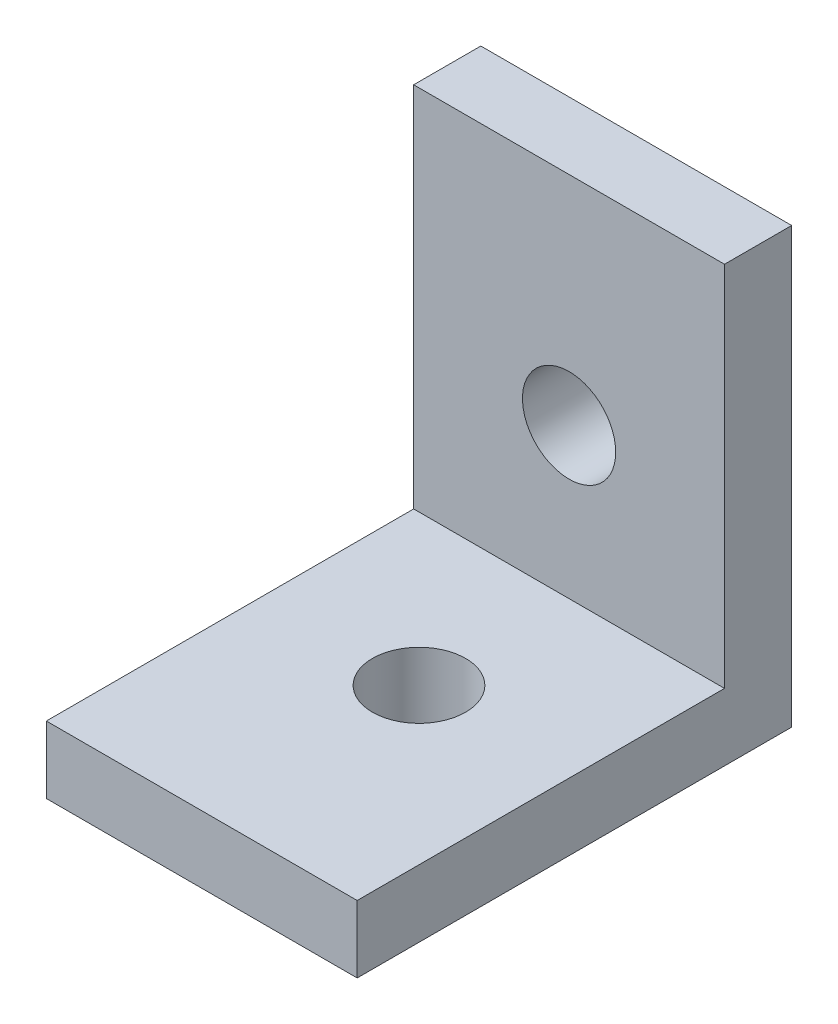
ISO-10303-21;
HEADER;
FILE_DESCRIPTION(('STEP AP214'),'2;1');
FILE_NAME('part.step','',(''),(''),'','','');
FILE_SCHEMA(('AUTOMOTIVE_DESIGN { 1 0 10303 214 1 1 1 1 }'));
ENDSEC;
DATA;
#1=APPLICATION_CONTEXT('core data for automotive mechanical design processes');
#2=APPLICATION_PROTOCOL_DEFINITION('international standard','automotive_design',2000,#1);
#3=PRODUCT_CONTEXT('',#1,'mechanical');
#4=PRODUCT('Part','Part','',(#3));
#5=PRODUCT_RELATED_PRODUCT_CATEGORY('part','',(#4));
#6=PRODUCT_DEFINITION_FORMATION('','',#4);
#7=PRODUCT_DEFINITION_CONTEXT('part definition',#1,'design');
#8=PRODUCT_DEFINITION('design','',#6,#7);
#9=PRODUCT_DEFINITION_SHAPE('','',#8);
#10=(LENGTH_UNIT() NAMED_UNIT(*) SI_UNIT(.MILLI.,.METRE.));
#11=(NAMED_UNIT(*) PLANE_ANGLE_UNIT() SI_UNIT($,.RADIAN.));
#12=(NAMED_UNIT(*) SI_UNIT($,.STERADIAN.) SOLID_ANGLE_UNIT());
#13=UNCERTAINTY_MEASURE_WITH_UNIT(LENGTH_MEASURE(1.E-05),#10,'distance_accuracy_value','');
#14=(GEOMETRIC_REPRESENTATION_CONTEXT(3) GLOBAL_UNCERTAINTY_ASSIGNED_CONTEXT((#13)) GLOBAL_UNIT_ASSIGNED_CONTEXT((#10,
#11,#12)) REPRESENTATION_CONTEXT('',''));
#15=CARTESIAN_POINT('',(0.,0.,0.));
#16=DIRECTION('',(0.,0.,1.));
#17=DIRECTION('',(1.,0.,0.));
#18=AXIS2_PLACEMENT_3D('',#15,#16,#17);
#19=CARTESIAN_POINT('',(0.,4.318,0.));
#20=DIRECTION('',(1.,0.,0.));
#21=DIRECTION('',(0.,0.,-1.));
#22=AXIS2_PLACEMENT_3D('',#19,#20,#21);
#23=PLANE('',#22);
#24=DIRECTION('',(0.,0.,1.));
#25=VECTOR('',#24,1.);
#26=CARTESIAN_POINT('',(0.,4.318,0.));
#27=LINE('',#26,#25);
#28=CARTESIAN_POINT('',(0.,4.318,-23.622));
#29=VERTEX_POINT('',#28);
#30=CARTESIAN_POINT('',(0.,4.318,0.));
#31=VERTEX_POINT('',#30);
#32=EDGE_CURVE('E100',#29,#31,#27,.T.);
#33=ORIENTED_EDGE('',*,*,#32,.F.);
#34=DIRECTION('',(0.,1.,0.));
#35=VECTOR('',#34,1.);
#36=CARTESIAN_POINT('',(0.,0.,-23.622));
#37=LINE('',#36,#35);
#38=CARTESIAN_POINT('',(0.,27.94,-23.622));
#39=VERTEX_POINT('',#38);
#40=EDGE_CURVE('E94',#29,#39,#37,.T.);
#41=ORIENTED_EDGE('',*,*,#40,.T.);
#42=DIRECTION('',(0.,0.,-1.));
#43=VECTOR('',#42,1.);
#44=CARTESIAN_POINT('',(0.,27.94,-23.622));
#45=LINE('',#44,#43);
#46=CARTESIAN_POINT('',(0.,27.94,-27.94));
#47=VERTEX_POINT('',#46);
#48=EDGE_CURVE('E97',#39,#47,#45,.T.);
#49=ORIENTED_EDGE('',*,*,#48,.T.);
#50=DIRECTION('',(0.,-1.,0.));
#51=VECTOR('',#50,1.);
#52=CARTESIAN_POINT('',(0.,4.318,-27.94));
#53=LINE('',#52,#51);
#54=CARTESIAN_POINT('',(0.,0.,-27.94));
#55=VERTEX_POINT('',#54);
#56=EDGE_CURVE('E139',#47,#55,#53,.T.);
#57=ORIENTED_EDGE('',*,*,#56,.T.);
#58=DIRECTION('',(0.,0.,1.));
#59=VECTOR('',#58,1.);
#60=CARTESIAN_POINT('',(0.,0.,0.));
#61=LINE('',#60,#59);
#62=CARTESIAN_POINT('',(0.,0.,0.));
#63=VERTEX_POINT('',#62);
#64=EDGE_CURVE('E130',#55,#63,#61,.T.);
#65=ORIENTED_EDGE('',*,*,#64,.T.);
#66=DIRECTION('',(0.,-1.,0.));
#67=VECTOR('',#66,1.);
#68=CARTESIAN_POINT('',(0.,4.318,0.));
#69=LINE('',#68,#67);
#70=EDGE_CURVE('E11',#31,#63,#69,.T.);
#71=ORIENTED_EDGE('',*,*,#70,.F.);
#72=EDGE_LOOP('',(#33,#41,#49,#57,#65,#71));
#73=FACE_BOUND('',#72,.T.);
#74=ADVANCED_FACE('F43',(#73),#23,.F.);
#75=CARTESIAN_POINT('',(0.,4.318,0.));
#76=DIRECTION('',(0.,0.,-1.));
#77=DIRECTION('',(-1.,0.,0.));
#78=AXIS2_PLACEMENT_3D('',#75,#76,#77);
#79=PLANE('',#78);
#80=DIRECTION('',(1.,0.,0.));
#81=VECTOR('',#80,1.);
#82=CARTESIAN_POINT('',(0.,0.,0.));
#83=LINE('',#82,#81);
#84=CARTESIAN_POINT('',(19.9898,0.,0.));
#85=VERTEX_POINT('',#84);
#86=EDGE_CURVE('E142',#63,#85,#83,.T.);
#87=ORIENTED_EDGE('',*,*,#86,.T.);
#88=DIRECTION('',(0.,-1.,0.));
#89=VECTOR('',#88,1.);
#90=CARTESIAN_POINT('',(19.9898,4.318,0.));
#91=LINE('',#90,#89);
#92=CARTESIAN_POINT('',(19.9898,4.318,0.));
#93=VERTEX_POINT('',#92);
#94=EDGE_CURVE('E51',#93,#85,#91,.T.);
#95=ORIENTED_EDGE('',*,*,#94,.F.);
#96=DIRECTION('',(1.,0.,0.));
#97=VECTOR('',#96,1.);
#98=CARTESIAN_POINT('',(0.,4.318,0.));
#99=LINE('',#98,#97);
#100=EDGE_CURVE('E133',#31,#93,#99,.T.);
#101=ORIENTED_EDGE('',*,*,#100,.F.);
#102=ORIENTED_EDGE('',*,*,#70,.T.);
#103=EDGE_LOOP('',(#87,#95,#101,#102));
#104=FACE_BOUND('',#103,.T.);
#105=ADVANCED_FACE('F170',(#104),#79,.F.);
#106=CARTESIAN_POINT('',(19.9898,4.318,0.));
#107=DIRECTION('',(-1.,0.,0.));
#108=DIRECTION('',(0.,0.,1.));
#109=AXIS2_PLACEMENT_3D('',#106,#107,#108);
#110=PLANE('',#109);
#111=DIRECTION('',(0.,0.,-1.));
#112=VECTOR('',#111,1.);
#113=CARTESIAN_POINT('',(19.9898,0.,0.));
#114=LINE('',#113,#112);
#115=CARTESIAN_POINT('',(19.9898,0.,-27.94));
#116=VERTEX_POINT('',#115);
#117=EDGE_CURVE('E145',#85,#116,#114,.T.);
#118=ORIENTED_EDGE('',*,*,#117,.T.);
#119=DIRECTION('',(0.,-1.,0.));
#120=VECTOR('',#119,1.);
#121=CARTESIAN_POINT('',(19.9898,4.318,-27.94));
#122=LINE('',#121,#120);
#123=CARTESIAN_POINT('',(19.9898,27.94,-27.94));
#124=VERTEX_POINT('',#123);
#125=EDGE_CURVE('E152',#124,#116,#122,.T.);
#126=ORIENTED_EDGE('',*,*,#125,.F.);
#127=DIRECTION('',(0.,0.,-1.));
#128=VECTOR('',#127,1.);
#129=CARTESIAN_POINT('',(19.9898,27.94,-23.622));
#130=LINE('',#129,#128);
#131=CARTESIAN_POINT('',(19.9898,27.94,-23.622));
#132=VERTEX_POINT('',#131);
#133=EDGE_CURVE('E114',#132,#124,#130,.T.);
#134=ORIENTED_EDGE('',*,*,#133,.F.);
#135=DIRECTION('',(0.,-1.,0.));
#136=VECTOR('',#135,1.);
#137=CARTESIAN_POINT('',(19.9898,0.,-23.622));
#138=LINE('',#137,#136);
#139=CARTESIAN_POINT('',(19.9898,4.318,-23.622));
#140=VERTEX_POINT('',#139);
#141=EDGE_CURVE('E105',#132,#140,#138,.T.);
#142=ORIENTED_EDGE('',*,*,#141,.T.);
#143=DIRECTION('',(0.,0.,-1.));
#144=VECTOR('',#143,1.);
#145=CARTESIAN_POINT('',(19.9898,4.318,0.));
#146=LINE('',#145,#144);
#147=EDGE_CURVE('E58',#93,#140,#146,.T.);
#148=ORIENTED_EDGE('',*,*,#147,.F.);
#149=ORIENTED_EDGE('',*,*,#94,.T.);
#150=EDGE_LOOP('',(#118,#126,#134,#142,#148,#149));
#151=FACE_BOUND('',#150,.T.);
#152=ADVANCED_FACE('F160',(#151),#110,.F.);
#153=CARTESIAN_POINT('',(0.,4.318,-27.94));
#154=DIRECTION('',(0.,0.,1.));
#155=DIRECTION('',(1.,0.,0.));
#156=AXIS2_PLACEMENT_3D('',#153,#154,#155);
#157=PLANE('',#156);
#158=CARTESIAN_POINT('',(9.9949,13.97,-27.94));
#159=DIRECTION('',(0.,0.,1.));
#160=DIRECTION('',(1.,0.,0.));
#161=AXIS2_PLACEMENT_3D('',#158,#159,#160);
#162=CIRCLE('',#161,2.9972);
#163=CARTESIAN_POINT('',(12.9921,13.97,-27.94));
#164=VERTEX_POINT('',#163);
#165=EDGE_CURVE('E278',#164,#164,#162,.T.);
#166=ORIENTED_EDGE('',*,*,#165,.T.);
#167=EDGE_LOOP('',(#166));
#168=FACE_BOUND('',#167,.T.);
#169=DIRECTION('',(-1.,0.,0.));
#170=VECTOR('',#169,1.);
#171=CARTESIAN_POINT('',(0.,0.,-27.94));
#172=LINE('',#171,#170);
#173=EDGE_CURVE('E134',#116,#55,#172,.T.);
#174=ORIENTED_EDGE('',*,*,#173,.T.);
#175=ORIENTED_EDGE('',*,*,#56,.F.);
#176=DIRECTION('',(1.,0.,0.));
#177=VECTOR('',#176,1.);
#178=CARTESIAN_POINT('',(19.9898,27.94,-27.94));
#179=LINE('',#178,#177);
#180=EDGE_CURVE('E112',#47,#124,#179,.T.);
#181=ORIENTED_EDGE('',*,*,#180,.T.);
#182=ORIENTED_EDGE('',*,*,#125,.T.);
#183=EDGE_LOOP('',(#174,#175,#181,#182));
#184=FACE_BOUND('',#183,.T.);
#185=ADVANCED_FACE('F169',(#168,#184),#157,.F.);
#186=CARTESIAN_POINT('',(0.,4.318,0.));
#187=DIRECTION('',(0.,-1.,0.));
#188=DIRECTION('',(0.,0.,-1.));
#189=AXIS2_PLACEMENT_3D('',#186,#187,#188);
#190=PLANE('',#189);
#191=CARTESIAN_POINT('',(9.99489999999999,4.318,-13.97));
#192=DIRECTION('',(0.,1.,0.));
#193=DIRECTION('',(0.,0.,1.));
#194=AXIS2_PLACEMENT_3D('',#191,#192,#193);
#195=CIRCLE('',#194,2.9972);
#196=CARTESIAN_POINT('',(9.99489999999999,4.318,-10.9728));
#197=VERTEX_POINT('',#196);
#198=EDGE_CURVE('E276',#197,#197,#195,.T.);
#199=ORIENTED_EDGE('',*,*,#198,.F.);
#200=EDGE_LOOP('',(#199));
#201=FACE_BOUND('',#200,.T.);
#202=ORIENTED_EDGE('',*,*,#147,.T.);
#203=DIRECTION('',(-1.,0.,0.));
#204=VECTOR('',#203,1.);
#205=CARTESIAN_POINT('',(0.,4.318,-23.622));
#206=LINE('',#205,#204);
#207=EDGE_CURVE('E62',#140,#29,#206,.T.);
#208=ORIENTED_EDGE('',*,*,#207,.T.);
#209=ORIENTED_EDGE('',*,*,#32,.T.);
#210=ORIENTED_EDGE('',*,*,#100,.T.);
#211=EDGE_LOOP('',(#202,#208,#209,#210));
#212=FACE_BOUND('',#211,.T.);
#213=ADVANCED_FACE('F171',(#201,#212),#190,.F.);
#214=CARTESIAN_POINT('',(0.,0.,0.));
#215=DIRECTION('',(0.,-1.,0.));
#216=DIRECTION('',(0.,0.,-1.));
#217=AXIS2_PLACEMENT_3D('',#214,#215,#216);
#218=PLANE('',#217);
#219=CARTESIAN_POINT('',(9.99489999999999,0.,-13.97));
#220=DIRECTION('',(0.,1.,0.));
#221=DIRECTION('',(0.,0.,1.));
#222=AXIS2_PLACEMENT_3D('',#219,#220,#221);
#223=CIRCLE('',#222,2.9972);
#224=CARTESIAN_POINT('',(9.99489999999999,0.,-10.9728));
#225=VERTEX_POINT('',#224);
#226=EDGE_CURVE('E125',#225,#225,#223,.T.);
#227=ORIENTED_EDGE('',*,*,#226,.T.);
#228=EDGE_LOOP('',(#227));
#229=FACE_BOUND('',#228,.T.);
#230=ORIENTED_EDGE('',*,*,#86,.F.);
#231=ORIENTED_EDGE('',*,*,#64,.F.);
#232=ORIENTED_EDGE('',*,*,#173,.F.);
#233=ORIENTED_EDGE('',*,*,#117,.F.);
#234=EDGE_LOOP('',(#230,#231,#232,#233));
#235=FACE_BOUND('',#234,.T.);
#236=ADVANCED_FACE('F166',(#229,#235),#218,.T.);
#237=CARTESIAN_POINT('',(0.,0.,-23.622));
#238=DIRECTION('',(0.,0.,1.));
#239=DIRECTION('',(1.,0.,0.));
#240=AXIS2_PLACEMENT_3D('',#237,#238,#239);
#241=PLANE('',#240);
#242=CARTESIAN_POINT('',(9.9949,13.97,-23.622));
#243=DIRECTION('',(0.,0.,1.));
#244=DIRECTION('',(1.,0.,0.));
#245=AXIS2_PLACEMENT_3D('',#242,#243,#244);
#246=CIRCLE('',#245,2.9972);
#247=CARTESIAN_POINT('',(12.9921,13.97,-23.622));
#248=VERTEX_POINT('',#247);
#249=EDGE_CURVE('E284',#248,#248,#246,.T.);
#250=ORIENTED_EDGE('',*,*,#249,.F.);
#251=EDGE_LOOP('',(#250));
#252=FACE_BOUND('',#251,.T.);
#253=ORIENTED_EDGE('',*,*,#207,.F.);
#254=ORIENTED_EDGE('',*,*,#141,.F.);
#255=DIRECTION('',(1.,0.,0.));
#256=VECTOR('',#255,1.);
#257=CARTESIAN_POINT('',(19.9898,27.94,-23.622));
#258=LINE('',#257,#256);
#259=EDGE_CURVE('E104',#39,#132,#258,.T.);
#260=ORIENTED_EDGE('',*,*,#259,.F.);
#261=ORIENTED_EDGE('',*,*,#40,.F.);
#262=EDGE_LOOP('',(#253,#254,#260,#261));
#263=FACE_BOUND('',#262,.T.);
#264=ADVANCED_FACE('F117',(#252,#263),#241,.T.);
#265=CARTESIAN_POINT('',(19.9898,27.94,-23.622));
#266=DIRECTION('',(0.,1.,0.));
#267=DIRECTION('',(0.,0.,1.));
#268=AXIS2_PLACEMENT_3D('',#265,#266,#267);
#269=PLANE('',#268);
#270=ORIENTED_EDGE('',*,*,#180,.F.);
#271=ORIENTED_EDGE('',*,*,#48,.F.);
#272=ORIENTED_EDGE('',*,*,#259,.T.);
#273=ORIENTED_EDGE('',*,*,#133,.T.);
#274=EDGE_LOOP('',(#270,#271,#272,#273));
#275=FACE_BOUND('',#274,.T.);
#276=ADVANCED_FACE('F109',(#275),#269,.T.);
#277=CARTESIAN_POINT('',(9.99489999999999,0.,-13.97));
#278=DIRECTION('',(0.,1.,0.));
#279=DIRECTION('',(0.,0.,1.));
#280=AXIS2_PLACEMENT_3D('',#277,#278,#279);
#281=CYLINDRICAL_SURFACE('',#280,2.9972);
#282=ORIENTED_EDGE('',*,*,#226,.F.);
#283=EDGE_LOOP('',(#282));
#284=FACE_BOUND('',#283,.T.);
#285=ORIENTED_EDGE('',*,*,#198,.T.);
#286=EDGE_LOOP('',(#285));
#287=FACE_BOUND('',#286,.T.);
#288=ADVANCED_FACE('F208',(#284,#287),#281,.F.);
#289=CARTESIAN_POINT('',(9.9949,13.97,-27.94));
#290=DIRECTION('',(0.,0.,1.));
#291=DIRECTION('',(1.,0.,0.));
#292=AXIS2_PLACEMENT_3D('',#289,#290,#291);
#293=CYLINDRICAL_SURFACE('',#292,2.9972);
#294=ORIENTED_EDGE('',*,*,#165,.F.);
#295=EDGE_LOOP('',(#294));
#296=FACE_BOUND('',#295,.T.);
#297=ORIENTED_EDGE('',*,*,#249,.T.);
#298=EDGE_LOOP('',(#297));
#299=FACE_BOUND('',#298,.T.);
#300=ADVANCED_FACE('F223',(#296,#299),#293,.F.);
#301=CLOSED_SHELL('',(#74,#105,#152,#185,#213,#236,#264,#276,#288,#300));
#302=MANIFOLD_SOLID_BREP('B2',#301);
#303=ADVANCED_BREP_SHAPE_REPRESENTATION('',(#18,#302),#14);
#304=SHAPE_DEFINITION_REPRESENTATION(#9,#303);
ENDSEC;
END-ISO-10303-21;
